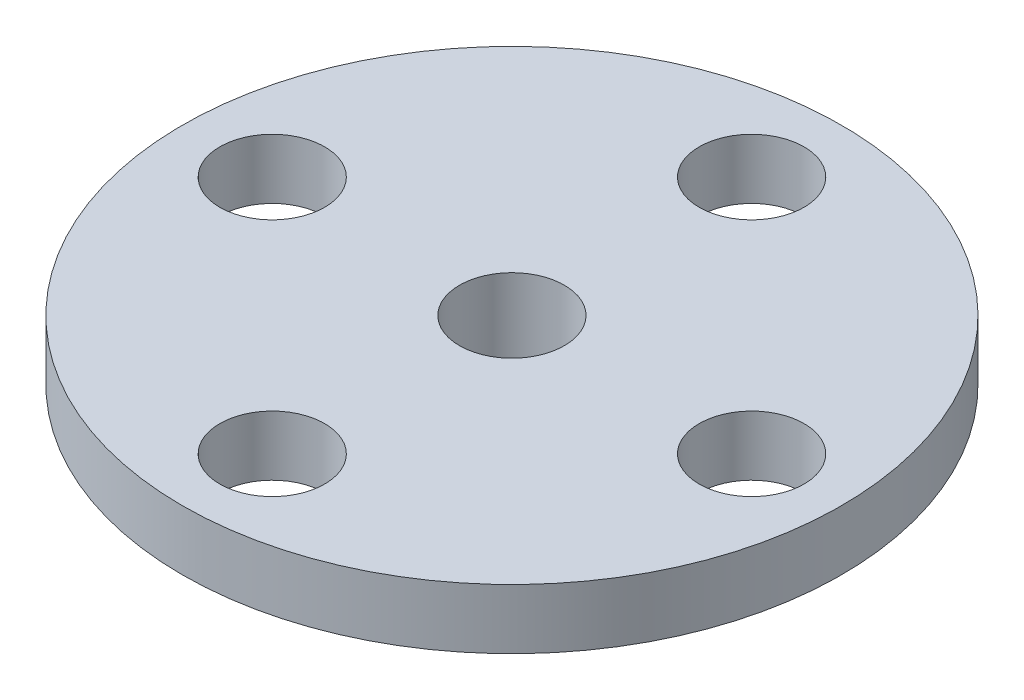
ISO-10303-21;
HEADER;
FILE_DESCRIPTION(('STEP AP214'),'2;1');
FILE_NAME('part.step','',(''),(''),'','','');
FILE_SCHEMA(('AUTOMOTIVE_DESIGN { 1 0 10303 214 1 1 1 1 }'));
ENDSEC;
DATA;
#1=APPLICATION_CONTEXT('core data for automotive mechanical design processes');
#2=APPLICATION_PROTOCOL_DEFINITION('international standard','automotive_design',2000,#1);
#3=PRODUCT_CONTEXT('',#1,'mechanical');
#4=PRODUCT('Part','Part','',(#3));
#5=PRODUCT_RELATED_PRODUCT_CATEGORY('part','',(#4));
#6=PRODUCT_DEFINITION_FORMATION('','',#4);
#7=PRODUCT_DEFINITION_CONTEXT('part definition',#1,'design');
#8=PRODUCT_DEFINITION('design','',#6,#7);
#9=PRODUCT_DEFINITION_SHAPE('','',#8);
#10=(LENGTH_UNIT() NAMED_UNIT(*) SI_UNIT(.MILLI.,.METRE.));
#11=(NAMED_UNIT(*) PLANE_ANGLE_UNIT() SI_UNIT($,.RADIAN.));
#12=(NAMED_UNIT(*) SI_UNIT($,.STERADIAN.) SOLID_ANGLE_UNIT());
#13=UNCERTAINTY_MEASURE_WITH_UNIT(LENGTH_MEASURE(1.E-05),#10,'distance_accuracy_value','');
#14=(GEOMETRIC_REPRESENTATION_CONTEXT(3) GLOBAL_UNCERTAINTY_ASSIGNED_CONTEXT((#13)) GLOBAL_UNIT_ASSIGNED_CONTEXT((#10,
#11,#12)) REPRESENTATION_CONTEXT('',''));
#15=CARTESIAN_POINT('',(0.,0.,0.));
#16=DIRECTION('',(0.,0.,1.));
#17=DIRECTION('',(1.,0.,0.));
#18=AXIS2_PLACEMENT_3D('',#15,#16,#17);
#19=CARTESIAN_POINT('',(0.,-4.2,0.));
#20=DIRECTION('',(0.,1.,0.));
#21=DIRECTION('',(0.,0.,1.));
#22=AXIS2_PLACEMENT_3D('',#19,#20,#21);
#23=PLANE('',#22);
#24=CARTESIAN_POINT('',(0.,-4.2,0.));
#25=DIRECTION('',(0.,1.,0.));
#26=DIRECTION('',(0.,0.,1.));
#27=AXIS2_PLACEMENT_3D('',#24,#25,#26);
#28=CIRCLE('',#27,2.85);
#29=CARTESIAN_POINT('',(0.,-4.2,2.85));
#30=VERTEX_POINT('',#29);
#31=EDGE_CURVE('E16',#30,#30,#28,.T.);
#32=ORIENTED_EDGE('',*,*,#31,.T.);
#33=EDGE_LOOP('',(#32));
#34=FACE_BOUND('',#33,.T.);
#35=CARTESIAN_POINT('',(0.,-4.2,0.));
#36=DIRECTION('',(0.,1.,0.));
#37=DIRECTION('',(0.,0.,1.));
#38=AXIS2_PLACEMENT_3D('',#35,#36,#37);
#39=CIRCLE('',#38,4.4);
#40=CARTESIAN_POINT('',(0.,-4.2,4.4));
#41=VERTEX_POINT('',#40);
#42=EDGE_CURVE('E62',#41,#41,#39,.T.);
#43=ORIENTED_EDGE('',*,*,#42,.F.);
#44=EDGE_LOOP('',(#43));
#45=FACE_BOUND('',#44,.T.);
#46=ADVANCED_FACE('F13',(#34,#45),#23,.F.);
#47=CARTESIAN_POINT('',(0.,-4.2,0.));
#48=DIRECTION('',(0.,1.,0.));
#49=DIRECTION('',(0.,0.,1.));
#50=AXIS2_PLACEMENT_3D('',#47,#48,#49);
#51=CYLINDRICAL_SURFACE('',#50,2.85);
#52=CARTESIAN_POINT('',(0.,-1.2,0.));
#53=DIRECTION('',(0.,1.,0.));
#54=DIRECTION('',(0.,0.,1.));
#55=AXIS2_PLACEMENT_3D('',#52,#53,#54);
#56=CIRCLE('',#55,2.85);
#57=CARTESIAN_POINT('',(0.,-1.2,2.85));
#58=VERTEX_POINT('',#57);
#59=EDGE_CURVE('E60',#58,#58,#56,.T.);
#60=ORIENTED_EDGE('',*,*,#59,.T.);
#61=EDGE_LOOP('',(#60));
#62=FACE_BOUND('',#61,.T.);
#63=ORIENTED_EDGE('',*,*,#31,.F.);
#64=EDGE_LOOP('',(#63));
#65=FACE_BOUND('',#64,.T.);
#66=ADVANCED_FACE('F71',(#62,#65),#51,.F.);
#67=CARTESIAN_POINT('',(0.,2.,0.));
#68=DIRECTION('',(0.,1.,0.));
#69=DIRECTION('',(0.,0.,1.));
#70=AXIS2_PLACEMENT_3D('',#67,#68,#69);
#71=CYLINDRICAL_SURFACE('',#70,4.4);
#72=ORIENTED_EDGE('',*,*,#42,.T.);
#73=EDGE_LOOP('',(#72));
#74=FACE_BOUND('',#73,.T.);
#75=CARTESIAN_POINT('',(0.,0.,0.));
#76=DIRECTION('',(0.,1.,0.));
#77=DIRECTION('',(0.,0.,1.));
#78=AXIS2_PLACEMENT_3D('',#75,#76,#77);
#79=CIRCLE('',#78,4.4);
#80=CARTESIAN_POINT('',(0.,0.,4.4));
#81=VERTEX_POINT('',#80);
#82=EDGE_CURVE('E57',#81,#81,#79,.F.);
#83=ORIENTED_EDGE('',*,*,#82,.T.);
#84=EDGE_LOOP('',(#83));
#85=FACE_BOUND('',#84,.T.);
#86=ADVANCED_FACE('F73',(#74,#85),#71,.T.);
#87=CARTESIAN_POINT('',(0.,-1.2,0.));
#88=DIRECTION('',(0.,1.,0.));
#89=DIRECTION('',(0.,0.,1.));
#90=AXIS2_PLACEMENT_3D('',#87,#88,#89);
#91=PLANE('',#90);
#92=CARTESIAN_POINT('',(0.,-1.2,0.));
#93=DIRECTION('',(0.,1.,0.));
#94=DIRECTION('',(0.,0.,1.));
#95=AXIS2_PLACEMENT_3D('',#92,#93,#94);
#96=CIRCLE('',#95,1.75);
#97=CARTESIAN_POINT('',(0.,-1.2,1.75));
#98=VERTEX_POINT('',#97);
#99=EDGE_CURVE('E51',#98,#98,#96,.T.);
#100=ORIENTED_EDGE('',*,*,#99,.T.);
#101=EDGE_LOOP('',(#100));
#102=FACE_BOUND('',#101,.T.);
#103=ORIENTED_EDGE('',*,*,#59,.F.);
#104=EDGE_LOOP('',(#103));
#105=FACE_BOUND('',#104,.T.);
#106=ADVANCED_FACE('F80',(#102,#105),#91,.F.);
#107=CARTESIAN_POINT('',(0.,0.,0.));
#108=DIRECTION('',(0.,1.,0.));
#109=DIRECTION('',(0.,0.,1.));
#110=AXIS2_PLACEMENT_3D('',#107,#108,#109);
#111=PLANE('',#110);
#112=CARTESIAN_POINT('',(0.,0.,-8.));
#113=DIRECTION('',(0.,1.,0.));
#114=DIRECTION('',(0.,0.,1.));
#115=AXIS2_PLACEMENT_3D('',#112,#113,#114);
#116=CIRCLE('',#115,1.75);
#117=CARTESIAN_POINT('',(0.,0.,-6.25));
#118=VERTEX_POINT('',#117);
#119=EDGE_CURVE('E39',#118,#118,#116,.T.);
#120=ORIENTED_EDGE('',*,*,#119,.T.);
#121=EDGE_LOOP('',(#120));
#122=FACE_BOUND('',#121,.T.);
#123=CARTESIAN_POINT('',(-8.,0.,0.));
#124=DIRECTION('',(0.,1.,0.));
#125=DIRECTION('',(0.,0.,1.));
#126=AXIS2_PLACEMENT_3D('',#123,#124,#125);
#127=CIRCLE('',#126,1.75);
#128=CARTESIAN_POINT('',(-8.,0.,1.75));
#129=VERTEX_POINT('',#128);
#130=EDGE_CURVE('E42',#129,#129,#127,.T.);
#131=ORIENTED_EDGE('',*,*,#130,.T.);
#132=EDGE_LOOP('',(#131));
#133=FACE_BOUND('',#132,.T.);
#134=CARTESIAN_POINT('',(0.,0.,8.));
#135=DIRECTION('',(0.,1.,0.));
#136=DIRECTION('',(0.,0.,1.));
#137=AXIS2_PLACEMENT_3D('',#134,#135,#136);
#138=CIRCLE('',#137,1.75);
#139=CARTESIAN_POINT('',(0.,0.,9.75));
#140=VERTEX_POINT('',#139);
#141=EDGE_CURVE('E45',#140,#140,#138,.T.);
#142=ORIENTED_EDGE('',*,*,#141,.T.);
#143=EDGE_LOOP('',(#142));
#144=FACE_BOUND('',#143,.T.);
#145=CARTESIAN_POINT('',(8.,0.,0.));
#146=DIRECTION('',(0.,1.,0.));
#147=DIRECTION('',(0.,0.,1.));
#148=AXIS2_PLACEMENT_3D('',#145,#146,#147);
#149=CIRCLE('',#148,1.75);
#150=CARTESIAN_POINT('',(8.,0.,1.75));
#151=VERTEX_POINT('',#150);
#152=EDGE_CURVE('E48',#151,#151,#149,.T.);
#153=ORIENTED_EDGE('',*,*,#152,.T.);
#154=EDGE_LOOP('',(#153));
#155=FACE_BOUND('',#154,.T.);
#156=ORIENTED_EDGE('',*,*,#82,.F.);
#157=EDGE_LOOP('',(#156));
#158=FACE_BOUND('',#157,.T.);
#159=CARTESIAN_POINT('',(0.,0.,0.));
#160=DIRECTION('',(0.,1.,0.));
#161=DIRECTION('',(0.,0.,1.));
#162=AXIS2_PLACEMENT_3D('',#159,#160,#161);
#163=CIRCLE('',#162,11.);
#164=CARTESIAN_POINT('',(0.,0.,11.));
#165=VERTEX_POINT('',#164);
#166=EDGE_CURVE('E54',#165,#165,#163,.T.);
#167=ORIENTED_EDGE('',*,*,#166,.F.);
#168=EDGE_LOOP('',(#167));
#169=FACE_BOUND('',#168,.T.);
#170=ADVANCED_FACE('F112',(#122,#133,#144,#155,#158,#169),#111,.F.);
#171=CARTESIAN_POINT('',(0.,0.,0.));
#172=DIRECTION('',(0.,1.,0.));
#173=DIRECTION('',(0.,0.,1.));
#174=AXIS2_PLACEMENT_3D('',#171,#172,#173);
#175=CYLINDRICAL_SURFACE('',#174,11.);
#176=CARTESIAN_POINT('',(0.,2.,0.));
#177=DIRECTION('',(0.,1.,0.));
#178=DIRECTION('',(0.,0.,1.));
#179=AXIS2_PLACEMENT_3D('',#176,#177,#178);
#180=CIRCLE('',#179,11.);
#181=CARTESIAN_POINT('',(0.,2.,11.));
#182=VERTEX_POINT('',#181);
#183=EDGE_CURVE('E36',#182,#182,#180,.T.);
#184=ORIENTED_EDGE('',*,*,#183,.F.);
#185=EDGE_LOOP('',(#184));
#186=FACE_BOUND('',#185,.T.);
#187=ORIENTED_EDGE('',*,*,#166,.T.);
#188=EDGE_LOOP('',(#187));
#189=FACE_BOUND('',#188,.T.);
#190=ADVANCED_FACE('F108',(#186,#189),#175,.T.);
#191=CARTESIAN_POINT('',(0.,-4.2,0.));
#192=DIRECTION('',(0.,1.,0.));
#193=DIRECTION('',(0.,0.,1.));
#194=AXIS2_PLACEMENT_3D('',#191,#192,#193);
#195=CYLINDRICAL_SURFACE('',#194,1.75);
#196=CARTESIAN_POINT('',(0.,2.,0.));
#197=DIRECTION('',(0.,1.,0.));
#198=DIRECTION('',(0.,0.,1.));
#199=AXIS2_PLACEMENT_3D('',#196,#197,#198);
#200=CIRCLE('',#199,1.75);
#201=CARTESIAN_POINT('',(0.,2.,1.75));
#202=VERTEX_POINT('',#201);
#203=EDGE_CURVE('E33',#202,#202,#200,.F.);
#204=ORIENTED_EDGE('',*,*,#203,.F.);
#205=EDGE_LOOP('',(#204));
#206=FACE_BOUND('',#205,.T.);
#207=ORIENTED_EDGE('',*,*,#99,.F.);
#208=EDGE_LOOP('',(#207));
#209=FACE_BOUND('',#208,.T.);
#210=ADVANCED_FACE('F104',(#206,#209),#195,.F.);
#211=CARTESIAN_POINT('',(8.,0.,0.));
#212=DIRECTION('',(0.,1.,0.));
#213=DIRECTION('',(0.,0.,1.));
#214=AXIS2_PLACEMENT_3D('',#211,#212,#213);
#215=CYLINDRICAL_SURFACE('',#214,1.75);
#216=CARTESIAN_POINT('',(8.,2.,0.));
#217=DIRECTION('',(0.,1.,0.));
#218=DIRECTION('',(0.,0.,1.));
#219=AXIS2_PLACEMENT_3D('',#216,#217,#218);
#220=CIRCLE('',#219,1.75);
#221=CARTESIAN_POINT('',(8.,2.,1.75));
#222=VERTEX_POINT('',#221);
#223=EDGE_CURVE('E30',#222,#222,#220,.F.);
#224=ORIENTED_EDGE('',*,*,#223,.F.);
#225=EDGE_LOOP('',(#224));
#226=FACE_BOUND('',#225,.T.);
#227=ORIENTED_EDGE('',*,*,#152,.F.);
#228=EDGE_LOOP('',(#227));
#229=FACE_BOUND('',#228,.T.);
#230=ADVANCED_FACE('F100',(#226,#229),#215,.F.);
#231=CARTESIAN_POINT('',(0.,0.,8.));
#232=DIRECTION('',(0.,1.,0.));
#233=DIRECTION('',(0.,0.,1.));
#234=AXIS2_PLACEMENT_3D('',#231,#232,#233);
#235=CYLINDRICAL_SURFACE('',#234,1.75);
#236=CARTESIAN_POINT('',(0.,2.,8.));
#237=DIRECTION('',(0.,1.,0.));
#238=DIRECTION('',(0.,0.,1.));
#239=AXIS2_PLACEMENT_3D('',#236,#237,#238);
#240=CIRCLE('',#239,1.75);
#241=CARTESIAN_POINT('',(0.,2.,9.75));
#242=VERTEX_POINT('',#241);
#243=EDGE_CURVE('E25',#242,#242,#240,.F.);
#244=ORIENTED_EDGE('',*,*,#243,.F.);
#245=EDGE_LOOP('',(#244));
#246=FACE_BOUND('',#245,.T.);
#247=ORIENTED_EDGE('',*,*,#141,.F.);
#248=EDGE_LOOP('',(#247));
#249=FACE_BOUND('',#248,.T.);
#250=ADVANCED_FACE('F96',(#246,#249),#235,.F.);
#251=CARTESIAN_POINT('',(-8.,0.,0.));
#252=DIRECTION('',(0.,1.,0.));
#253=DIRECTION('',(0.,0.,1.));
#254=AXIS2_PLACEMENT_3D('',#251,#252,#253);
#255=CYLINDRICAL_SURFACE('',#254,1.75);
#256=CARTESIAN_POINT('',(-8.,2.,0.));
#257=DIRECTION('',(0.,1.,0.));
#258=DIRECTION('',(0.,0.,1.));
#259=AXIS2_PLACEMENT_3D('',#256,#257,#258);
#260=CIRCLE('',#259,1.75);
#261=CARTESIAN_POINT('',(-8.,2.,1.75));
#262=VERTEX_POINT('',#261);
#263=EDGE_CURVE('E20',#262,#262,#260,.F.);
#264=ORIENTED_EDGE('',*,*,#263,.F.);
#265=EDGE_LOOP('',(#264));
#266=FACE_BOUND('',#265,.T.);
#267=ORIENTED_EDGE('',*,*,#130,.F.);
#268=EDGE_LOOP('',(#267));
#269=FACE_BOUND('',#268,.T.);
#270=ADVANCED_FACE('F89',(#266,#269),#255,.F.);
#271=CARTESIAN_POINT('',(0.,0.,-8.));
#272=DIRECTION('',(0.,1.,0.));
#273=DIRECTION('',(0.,0.,1.));
#274=AXIS2_PLACEMENT_3D('',#271,#272,#273);
#275=CYLINDRICAL_SURFACE('',#274,1.75);
#276=CARTESIAN_POINT('',(0.,2.,-8.));
#277=DIRECTION('',(0.,1.,0.));
#278=DIRECTION('',(0.,0.,1.));
#279=AXIS2_PLACEMENT_3D('',#276,#277,#278);
#280=CIRCLE('',#279,1.75);
#281=CARTESIAN_POINT('',(0.,2.,-6.25));
#282=VERTEX_POINT('',#281);
#283=EDGE_CURVE('E9',#282,#282,#280,.F.);
#284=ORIENTED_EDGE('',*,*,#283,.F.);
#285=EDGE_LOOP('',(#284));
#286=FACE_BOUND('',#285,.T.);
#287=ORIENTED_EDGE('',*,*,#119,.F.);
#288=EDGE_LOOP('',(#287));
#289=FACE_BOUND('',#288,.T.);
#290=ADVANCED_FACE('F84',(#286,#289),#275,.F.);
#291=CARTESIAN_POINT('',(0.,2.,0.));
#292=DIRECTION('',(0.,1.,0.));
#293=DIRECTION('',(0.,0.,1.));
#294=AXIS2_PLACEMENT_3D('',#291,#292,#293);
#295=PLANE('',#294);
#296=ORIENTED_EDGE('',*,*,#283,.T.);
#297=EDGE_LOOP('',(#296));
#298=FACE_BOUND('',#297,.T.);
#299=ORIENTED_EDGE('',*,*,#263,.T.);
#300=EDGE_LOOP('',(#299));
#301=FACE_BOUND('',#300,.T.);
#302=ORIENTED_EDGE('',*,*,#243,.T.);
#303=EDGE_LOOP('',(#302));
#304=FACE_BOUND('',#303,.T.);
#305=ORIENTED_EDGE('',*,*,#223,.T.);
#306=EDGE_LOOP('',(#305));
#307=FACE_BOUND('',#306,.T.);
#308=ORIENTED_EDGE('',*,*,#203,.T.);
#309=EDGE_LOOP('',(#308));
#310=FACE_BOUND('',#309,.T.);
#311=ORIENTED_EDGE('',*,*,#183,.T.);
#312=EDGE_LOOP('',(#311));
#313=FACE_BOUND('',#312,.T.);
#314=ADVANCED_FACE('F82',(#298,#301,#304,#307,#310,#313),#295,.T.);
#315=CLOSED_SHELL('',(#46,#66,#86,#106,#170,#190,#210,#230,#250,#270,#290,#314));
#316=MANIFOLD_SOLID_BREP('B1',#315);
#317=ADVANCED_BREP_SHAPE_REPRESENTATION('',(#18,#316),#14);
#318=SHAPE_DEFINITION_REPRESENTATION(#9,#317);
ENDSEC;
END-ISO-10303-21;
